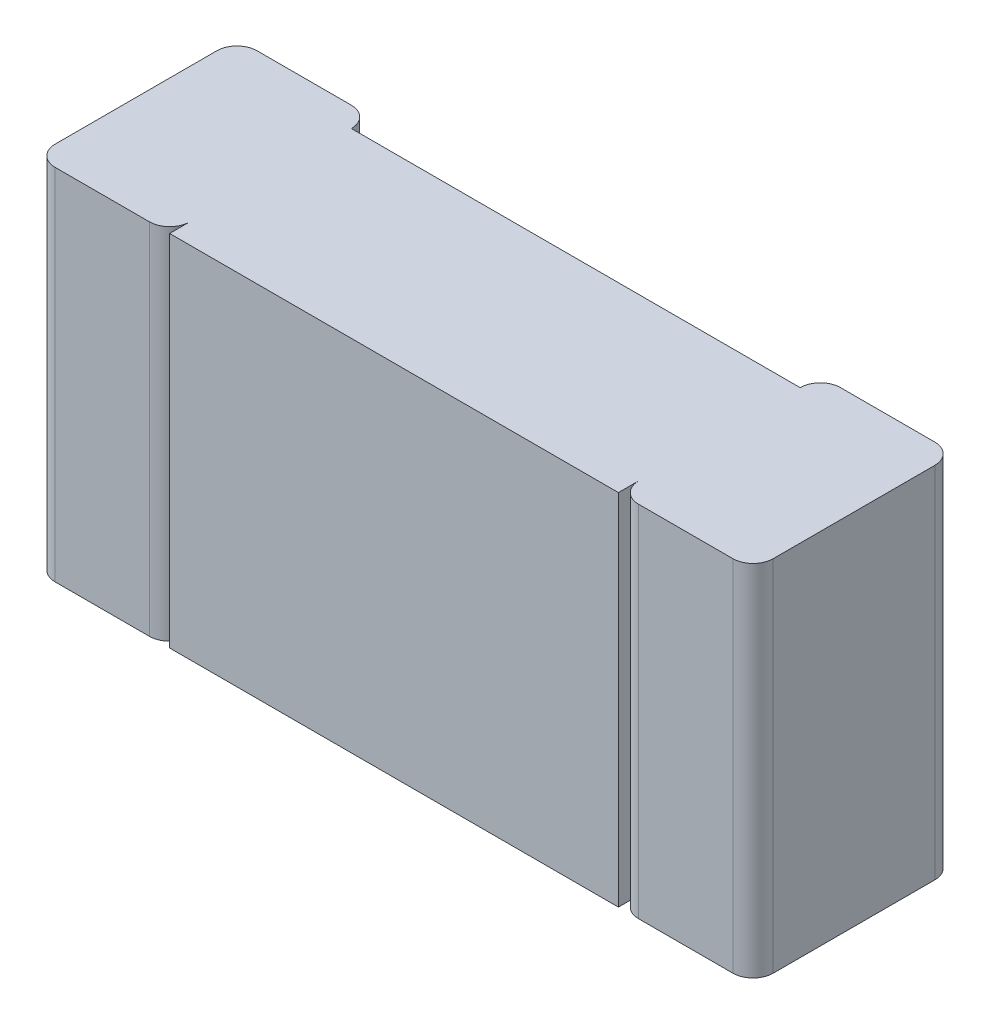
ISO-10303-21;
HEADER;
FILE_DESCRIPTION(('STEP AP214'),'2;1');
FILE_NAME('part.step','',(''),(''),'','','');
FILE_SCHEMA(('AUTOMOTIVE_DESIGN { 1 0 10303 214 1 1 1 1 }'));
ENDSEC;
DATA;
#1=APPLICATION_CONTEXT('core data for automotive mechanical design processes');
#2=APPLICATION_PROTOCOL_DEFINITION('international standard','automotive_design',2000,#1);
#3=PRODUCT_CONTEXT('',#1,'mechanical');
#4=PRODUCT('Part','Part','',(#3));
#5=PRODUCT_RELATED_PRODUCT_CATEGORY('part','',(#4));
#6=PRODUCT_DEFINITION_FORMATION('','',#4);
#7=PRODUCT_DEFINITION_CONTEXT('part definition',#1,'design');
#8=PRODUCT_DEFINITION('design','',#6,#7);
#9=PRODUCT_DEFINITION_SHAPE('','',#8);
#10=(LENGTH_UNIT() NAMED_UNIT(*) SI_UNIT(.MILLI.,.METRE.));
#11=(NAMED_UNIT(*) PLANE_ANGLE_UNIT() SI_UNIT($,.RADIAN.));
#12=(NAMED_UNIT(*) SI_UNIT($,.STERADIAN.) SOLID_ANGLE_UNIT());
#13=UNCERTAINTY_MEASURE_WITH_UNIT(LENGTH_MEASURE(1.E-05),#10,'distance_accuracy_value','');
#14=(GEOMETRIC_REPRESENTATION_CONTEXT(3) GLOBAL_UNCERTAINTY_ASSIGNED_CONTEXT((#13)) GLOBAL_UNIT_ASSIGNED_CONTEXT((#10,
#11,#12)) REPRESENTATION_CONTEXT('',''));
#15=CARTESIAN_POINT('',(0.,0.,0.));
#16=DIRECTION('',(0.,0.,1.));
#17=DIRECTION('',(1.,0.,0.));
#18=AXIS2_PLACEMENT_3D('',#15,#16,#17);
#19=CARTESIAN_POINT('',(-0.5,-0.4,0.405));
#20=DIRECTION('',(1.,0.,0.));
#21=DIRECTION('',(0.,0.,-1.));
#22=AXIS2_PLACEMENT_3D('',#19,#20,#21);
#23=PLANE('',#22);
#24=DIRECTION('',(0.,1.,0.));
#25=VECTOR('',#24,1.);
#26=CARTESIAN_POINT('',(-0.5,-0.4,0.45));
#27=LINE('',#26,#25);
#28=CARTESIAN_POINT('',(-0.5,0.4,0.45));
#29=VERTEX_POINT('',#28);
#30=CARTESIAN_POINT('',(-0.5,-0.4,0.45));
#31=VERTEX_POINT('',#30);
#32=EDGE_CURVE('E196',#29,#31,#27,.F.);
#33=ORIENTED_EDGE('',*,*,#32,.F.);
#34=DIRECTION('',(0.,0.,1.));
#35=VECTOR('',#34,1.);
#36=CARTESIAN_POINT('',(-0.5,0.4,0.405));
#37=LINE('',#36,#35);
#38=CARTESIAN_POINT('',(-0.5,0.4,0.405));
#39=VERTEX_POINT('',#38);
#40=EDGE_CURVE('E203',#39,#29,#37,.T.);
#41=ORIENTED_EDGE('',*,*,#40,.F.);
#42=DIRECTION('',(0.,1.,0.));
#43=VECTOR('',#42,1.);
#44=CARTESIAN_POINT('',(-0.5,-0.4,0.405));
#45=LINE('',#44,#43);
#46=CARTESIAN_POINT('',(-0.5,-0.4,0.405));
#47=VERTEX_POINT('',#46);
#48=EDGE_CURVE('E172',#47,#39,#45,.T.);
#49=ORIENTED_EDGE('',*,*,#48,.F.);
#50=DIRECTION('',(0.,0.,1.));
#51=VECTOR('',#50,1.);
#52=CARTESIAN_POINT('',(-0.5,-0.4,0.405));
#53=LINE('',#52,#51);
#54=EDGE_CURVE('E159',#47,#31,#53,.T.);
#55=ORIENTED_EDGE('',*,*,#54,.T.);
#56=EDGE_LOOP('',(#33,#41,#49,#55));
#57=FACE_BOUND('',#56,.T.);
#58=ADVANCED_FACE('F17',(#57),#23,.F.);
#59=CARTESIAN_POINT('',(-0.5,-0.4,0.45));
#60=DIRECTION('',(0.,0.,1.));
#61=DIRECTION('',(1.,0.,0.));
#62=AXIS2_PLACEMENT_3D('',#59,#60,#61);
#63=PLANE('',#62);
#64=DIRECTION('',(0.,1.,0.));
#65=VECTOR('',#64,1.);
#66=CARTESIAN_POINT('',(0.5,-0.4,0.45));
#67=LINE('',#66,#65);
#68=CARTESIAN_POINT('',(0.5,0.4,0.45));
#69=VERTEX_POINT('',#68);
#70=CARTESIAN_POINT('',(0.5,-0.4,0.45));
#71=VERTEX_POINT('',#70);
#72=EDGE_CURVE('E139',#69,#71,#67,.F.);
#73=ORIENTED_EDGE('',*,*,#72,.F.);
#74=DIRECTION('',(1.,0.,0.));
#75=VECTOR('',#74,1.);
#76=CARTESIAN_POINT('',(-0.5,0.4,0.45));
#77=LINE('',#76,#75);
#78=EDGE_CURVE('E199',#29,#69,#77,.T.);
#79=ORIENTED_EDGE('',*,*,#78,.F.);
#80=ORIENTED_EDGE('',*,*,#32,.T.);
#81=DIRECTION('',(1.,0.,0.));
#82=VECTOR('',#81,1.);
#83=CARTESIAN_POINT('',(-0.5,-0.4,0.45));
#84=LINE('',#83,#82);
#85=EDGE_CURVE('E156',#31,#71,#84,.T.);
#86=ORIENTED_EDGE('',*,*,#85,.T.);
#87=EDGE_LOOP('',(#73,#79,#80,#86));
#88=FACE_BOUND('',#87,.T.);
#89=ADVANCED_FACE('F359',(#88),#63,.T.);
#90=CARTESIAN_POINT('',(0.5,-0.4,0.405));
#91=DIRECTION('',(1.,0.,0.));
#92=DIRECTION('',(0.,0.,-1.));
#93=AXIS2_PLACEMENT_3D('',#90,#91,#92);
#94=PLANE('',#93);
#95=DIRECTION('',(0.,0.,1.));
#96=VECTOR('',#95,1.);
#97=CARTESIAN_POINT('',(0.5,0.4,0.405));
#98=LINE('',#97,#96);
#99=CARTESIAN_POINT('',(0.5,0.4,0.405));
#100=VERTEX_POINT('',#99);
#101=EDGE_CURVE('E202',#69,#100,#98,.F.);
#102=ORIENTED_EDGE('',*,*,#101,.F.);
#103=ORIENTED_EDGE('',*,*,#72,.T.);
#104=DIRECTION('',(0.,0.,1.));
#105=VECTOR('',#104,1.);
#106=CARTESIAN_POINT('',(0.5,-0.4,0.405));
#107=LINE('',#106,#105);
#108=CARTESIAN_POINT('',(0.5,-0.4,0.405));
#109=VERTEX_POINT('',#108);
#110=EDGE_CURVE('E147',#71,#109,#107,.F.);
#111=ORIENTED_EDGE('',*,*,#110,.T.);
#112=DIRECTION('',(0.,1.,0.));
#113=VECTOR('',#112,1.);
#114=CARTESIAN_POINT('',(0.5,-0.4,0.405));
#115=LINE('',#114,#113);
#116=EDGE_CURVE('E130',#100,#109,#115,.F.);
#117=ORIENTED_EDGE('',*,*,#116,.F.);
#118=EDGE_LOOP('',(#102,#103,#111,#117));
#119=FACE_BOUND('',#118,.T.);
#120=ADVANCED_FACE('F154',(#119),#94,.T.);
#121=CARTESIAN_POINT('',(0.545,-0.4,0.405));
#122=DIRECTION('',(0.,1.,0.));
#123=DIRECTION('',(0.,0.,1.));
#124=AXIS2_PLACEMENT_3D('',#121,#122,#123);
#125=CYLINDRICAL_SURFACE('',#124,0.045);
#126=CARTESIAN_POINT('',(0.545,0.4,0.405));
#127=DIRECTION('',(0.,1.,0.));
#128=DIRECTION('',(0.,0.,1.));
#129=AXIS2_PLACEMENT_3D('',#126,#127,#128);
#130=CIRCLE('',#129,0.045);
#131=CARTESIAN_POINT('',(0.545,0.4,0.45));
#132=VERTEX_POINT('',#131);
#133=EDGE_CURVE('E134',#100,#132,#130,.T.);
#134=ORIENTED_EDGE('',*,*,#133,.F.);
#135=ORIENTED_EDGE('',*,*,#116,.T.);
#136=CARTESIAN_POINT('',(0.545,-0.4,0.405));
#137=DIRECTION('',(0.,1.,0.));
#138=DIRECTION('',(0.,0.,1.));
#139=AXIS2_PLACEMENT_3D('',#136,#137,#138);
#140=CIRCLE('',#139,0.045);
#141=CARTESIAN_POINT('',(0.545,-0.4,0.45));
#142=VERTEX_POINT('',#141);
#143=EDGE_CURVE('E20',#109,#142,#140,.T.);
#144=ORIENTED_EDGE('',*,*,#143,.T.);
#145=DIRECTION('',(0.,1.,0.));
#146=VECTOR('',#145,1.);
#147=CARTESIAN_POINT('',(0.545,-0.4,0.45));
#148=LINE('',#147,#146);
#149=EDGE_CURVE('E138',#132,#142,#148,.F.);
#150=ORIENTED_EDGE('',*,*,#149,.F.);
#151=EDGE_LOOP('',(#134,#135,#144,#150));
#152=FACE_BOUND('',#151,.T.);
#153=ADVANCED_FACE('F132',(#152),#125,.T.);
#154=CARTESIAN_POINT('',(0.5,-0.4,0.45));
#155=DIRECTION('',(0.,0.,1.));
#156=DIRECTION('',(1.,0.,0.));
#157=AXIS2_PLACEMENT_3D('',#154,#155,#156);
#158=PLANE('',#157);
#159=DIRECTION('',(1.,0.,0.));
#160=VECTOR('',#159,1.);
#161=CARTESIAN_POINT('',(0.5,-0.4,0.45));
#162=LINE('',#161,#160);
#163=CARTESIAN_POINT('',(0.755,-0.4,0.45));
#164=VERTEX_POINT('',#163);
#165=EDGE_CURVE('E151',#142,#164,#162,.T.);
#166=ORIENTED_EDGE('',*,*,#165,.T.);
#167=DIRECTION('',(0.,1.,0.));
#168=VECTOR('',#167,1.);
#169=CARTESIAN_POINT('',(0.755,-0.4,0.45));
#170=LINE('',#169,#168);
#171=CARTESIAN_POINT('',(0.755,0.4,0.45));
#172=VERTEX_POINT('',#171);
#173=EDGE_CURVE('E191',#172,#164,#170,.F.);
#174=ORIENTED_EDGE('',*,*,#173,.F.);
#175=DIRECTION('',(1.,0.,0.));
#176=VECTOR('',#175,1.);
#177=CARTESIAN_POINT('',(0.5,0.4,0.45));
#178=LINE('',#177,#176);
#179=EDGE_CURVE('E248',#132,#172,#178,.T.);
#180=ORIENTED_EDGE('',*,*,#179,.F.);
#181=ORIENTED_EDGE('',*,*,#149,.T.);
#182=EDGE_LOOP('',(#166,#174,#180,#181));
#183=FACE_BOUND('',#182,.T.);
#184=ADVANCED_FACE('F316',(#183),#158,.T.);
#185=CARTESIAN_POINT('',(0.755,-0.4,0.405));
#186=DIRECTION('',(0.,1.,0.));
#187=DIRECTION('',(0.,0.,1.));
#188=AXIS2_PLACEMENT_3D('',#185,#186,#187);
#189=CYLINDRICAL_SURFACE('',#188,0.045);
#190=ORIENTED_EDGE('',*,*,#173,.T.);
#191=CARTESIAN_POINT('',(0.755,-0.4,0.405));
#192=DIRECTION('',(0.,1.,0.));
#193=DIRECTION('',(0.,0.,1.));
#194=AXIS2_PLACEMENT_3D('',#191,#192,#193);
#195=CIRCLE('',#194,0.045);
#196=CARTESIAN_POINT('',(0.8,-0.4,0.405));
#197=VERTEX_POINT('',#196);
#198=EDGE_CURVE('E255',#164,#197,#195,.T.);
#199=ORIENTED_EDGE('',*,*,#198,.T.);
#200=DIRECTION('',(0.,1.,0.));
#201=VECTOR('',#200,1.);
#202=CARTESIAN_POINT('',(0.8,-0.4,0.405));
#203=LINE('',#202,#201);
#204=CARTESIAN_POINT('',(0.8,0.4,0.405));
#205=VERTEX_POINT('',#204);
#206=EDGE_CURVE('E189',#205,#197,#203,.F.);
#207=ORIENTED_EDGE('',*,*,#206,.F.);
#208=CARTESIAN_POINT('',(0.755,0.4,0.405));
#209=DIRECTION('',(0.,1.,0.));
#210=DIRECTION('',(0.,0.,1.));
#211=AXIS2_PLACEMENT_3D('',#208,#209,#210);
#212=CIRCLE('',#211,0.045);
#213=EDGE_CURVE('E246',#172,#205,#212,.T.);
#214=ORIENTED_EDGE('',*,*,#213,.F.);
#215=EDGE_LOOP('',(#190,#199,#207,#214));
#216=FACE_BOUND('',#215,.T.);
#217=ADVANCED_FACE('F320',(#216),#189,.T.);
#218=CARTESIAN_POINT('',(0.8,-0.4,0.));
#219=DIRECTION('',(1.,0.,0.));
#220=DIRECTION('',(0.,0.,-1.));
#221=AXIS2_PLACEMENT_3D('',#218,#219,#220);
#222=PLANE('',#221);
#223=DIRECTION('',(0.,0.,1.));
#224=VECTOR('',#223,1.);
#225=CARTESIAN_POINT('',(0.8,0.4,0.));
#226=LINE('',#225,#224);
#227=CARTESIAN_POINT('',(0.8,0.4,0.045));
#228=VERTEX_POINT('',#227);
#229=EDGE_CURVE('E245',#205,#228,#226,.F.);
#230=ORIENTED_EDGE('',*,*,#229,.F.);
#231=ORIENTED_EDGE('',*,*,#206,.T.);
#232=DIRECTION('',(0.,0.,1.));
#233=VECTOR('',#232,1.);
#234=CARTESIAN_POINT('',(0.8,-0.4,0.));
#235=LINE('',#234,#233);
#236=CARTESIAN_POINT('',(0.8,-0.4,0.045));
#237=VERTEX_POINT('',#236);
#238=EDGE_CURVE('E254',#197,#237,#235,.F.);
#239=ORIENTED_EDGE('',*,*,#238,.T.);
#240=DIRECTION('',(0.,1.,0.));
#241=VECTOR('',#240,1.);
#242=CARTESIAN_POINT('',(0.8,-0.4,0.045));
#243=LINE('',#242,#241);
#244=EDGE_CURVE('E182',#228,#237,#243,.F.);
#245=ORIENTED_EDGE('',*,*,#244,.F.);
#246=EDGE_LOOP('',(#230,#231,#239,#245));
#247=FACE_BOUND('',#246,.T.);
#248=ADVANCED_FACE('F323',(#247),#222,.T.);
#249=CARTESIAN_POINT('',(0.755,-0.4,0.045));
#250=DIRECTION('',(0.,1.,0.));
#251=DIRECTION('',(0.,0.,1.));
#252=AXIS2_PLACEMENT_3D('',#249,#250,#251);
#253=CYLINDRICAL_SURFACE('',#252,0.045);
#254=CARTESIAN_POINT('',(0.755,0.4,0.045));
#255=DIRECTION('',(0.,1.,0.));
#256=DIRECTION('',(0.,0.,1.));
#257=AXIS2_PLACEMENT_3D('',#254,#255,#256);
#258=CIRCLE('',#257,0.045);
#259=CARTESIAN_POINT('',(0.755,0.4,0.));
#260=VERTEX_POINT('',#259);
#261=EDGE_CURVE('E242',#228,#260,#258,.T.);
#262=ORIENTED_EDGE('',*,*,#261,.F.);
#263=ORIENTED_EDGE('',*,*,#244,.T.);
#264=CARTESIAN_POINT('',(0.755,-0.4,0.045));
#265=DIRECTION('',(0.,1.,0.));
#266=DIRECTION('',(0.,0.,1.));
#267=AXIS2_PLACEMENT_3D('',#264,#265,#266);
#268=CIRCLE('',#267,0.045);
#269=CARTESIAN_POINT('',(0.755,-0.4,0.));
#270=VERTEX_POINT('',#269);
#271=EDGE_CURVE('E251',#237,#270,#268,.T.);
#272=ORIENTED_EDGE('',*,*,#271,.T.);
#273=DIRECTION('',(0.,1.,0.));
#274=VECTOR('',#273,1.);
#275=CARTESIAN_POINT('',(0.755,-0.4,0.));
#276=LINE('',#275,#274);
#277=EDGE_CURVE('E152',#270,#260,#276,.T.);
#278=ORIENTED_EDGE('',*,*,#277,.T.);
#279=EDGE_LOOP('',(#262,#263,#272,#278));
#280=FACE_BOUND('',#279,.T.);
#281=ADVANCED_FACE('F327',(#280),#253,.T.);
#282=CARTESIAN_POINT('',(-0.755,-0.4,0.045));
#283=DIRECTION('',(0.,1.,0.));
#284=DIRECTION('',(0.,0.,1.));
#285=AXIS2_PLACEMENT_3D('',#282,#283,#284);
#286=CYLINDRICAL_SURFACE('',#285,0.045);
#287=DIRECTION('',(0.,1.,0.));
#288=VECTOR('',#287,1.);
#289=CARTESIAN_POINT('',(-0.755,-0.4,0.));
#290=LINE('',#289,#288);
#291=CARTESIAN_POINT('',(-0.755,0.4,0.));
#292=VERTEX_POINT('',#291);
#293=CARTESIAN_POINT('',(-0.755,-0.4,0.));
#294=VERTEX_POINT('',#293);
#295=EDGE_CURVE('E183',#292,#294,#290,.F.);
#296=ORIENTED_EDGE('',*,*,#295,.T.);
#297=CARTESIAN_POINT('',(-0.755,-0.4,0.045));
#298=DIRECTION('',(0.,1.,0.));
#299=DIRECTION('',(0.,0.,1.));
#300=AXIS2_PLACEMENT_3D('',#297,#298,#299);
#301=CIRCLE('',#300,0.045);
#302=CARTESIAN_POINT('',(-0.8,-0.4,0.045));
#303=VERTEX_POINT('',#302);
#304=EDGE_CURVE('E239',#294,#303,#301,.T.);
#305=ORIENTED_EDGE('',*,*,#304,.T.);
#306=DIRECTION('',(0.,1.,0.));
#307=VECTOR('',#306,1.);
#308=CARTESIAN_POINT('',(-0.8,-0.4,0.045));
#309=LINE('',#308,#307);
#310=CARTESIAN_POINT('',(-0.8,0.4,0.045));
#311=VERTEX_POINT('',#310);
#312=EDGE_CURVE('E179',#303,#311,#309,.T.);
#313=ORIENTED_EDGE('',*,*,#312,.T.);
#314=CARTESIAN_POINT('',(-0.755,0.4,0.045));
#315=DIRECTION('',(0.,1.,0.));
#316=DIRECTION('',(0.,0.,1.));
#317=AXIS2_PLACEMENT_3D('',#314,#315,#316);
#318=CIRCLE('',#317,0.045);
#319=EDGE_CURVE('E229',#292,#311,#318,.T.);
#320=ORIENTED_EDGE('',*,*,#319,.F.);
#321=EDGE_LOOP('',(#296,#305,#313,#320));
#322=FACE_BOUND('',#321,.T.);
#323=ADVANCED_FACE('F350',(#322),#286,.T.);
#324=CARTESIAN_POINT('',(-0.8,-0.4,0.));
#325=DIRECTION('',(1.,0.,0.));
#326=DIRECTION('',(0.,0.,-1.));
#327=AXIS2_PLACEMENT_3D('',#324,#325,#326);
#328=PLANE('',#327);
#329=DIRECTION('',(0.,1.,0.));
#330=VECTOR('',#329,1.);
#331=CARTESIAN_POINT('',(-0.8,-0.4,0.405));
#332=LINE('',#331,#330);
#333=CARTESIAN_POINT('',(-0.8,0.4,0.405));
#334=VERTEX_POINT('',#333);
#335=CARTESIAN_POINT('',(-0.8,-0.4,0.405));
#336=VERTEX_POINT('',#335);
#337=EDGE_CURVE('E177',#334,#336,#332,.F.);
#338=ORIENTED_EDGE('',*,*,#337,.F.);
#339=DIRECTION('',(0.,0.,1.));
#340=VECTOR('',#339,1.);
#341=CARTESIAN_POINT('',(-0.8,0.4,0.));
#342=LINE('',#341,#340);
#343=EDGE_CURVE('E228',#311,#334,#342,.T.);
#344=ORIENTED_EDGE('',*,*,#343,.F.);
#345=ORIENTED_EDGE('',*,*,#312,.F.);
#346=DIRECTION('',(0.,0.,1.));
#347=VECTOR('',#346,1.);
#348=CARTESIAN_POINT('',(-0.8,-0.4,0.));
#349=LINE('',#348,#347);
#350=EDGE_CURVE('E238',#303,#336,#349,.T.);
#351=ORIENTED_EDGE('',*,*,#350,.T.);
#352=EDGE_LOOP('',(#338,#344,#345,#351));
#353=FACE_BOUND('',#352,.T.);
#354=ADVANCED_FACE('F354',(#353),#328,.F.);
#355=CARTESIAN_POINT('',(-0.755,-0.4,0.405));
#356=DIRECTION('',(0.,1.,0.));
#357=DIRECTION('',(0.,0.,1.));
#358=AXIS2_PLACEMENT_3D('',#355,#356,#357);
#359=CYLINDRICAL_SURFACE('',#358,0.045);
#360=CARTESIAN_POINT('',(-0.755,0.4,0.405));
#361=DIRECTION('',(0.,1.,0.));
#362=DIRECTION('',(0.,0.,1.));
#363=AXIS2_PLACEMENT_3D('',#360,#361,#362);
#364=CIRCLE('',#363,0.045);
#365=CARTESIAN_POINT('',(-0.755,0.4,0.45));
#366=VERTEX_POINT('',#365);
#367=EDGE_CURVE('E226',#334,#366,#364,.T.);
#368=ORIENTED_EDGE('',*,*,#367,.F.);
#369=ORIENTED_EDGE('',*,*,#337,.T.);
#370=CARTESIAN_POINT('',(-0.755,-0.4,0.405));
#371=DIRECTION('',(0.,1.,0.));
#372=DIRECTION('',(0.,0.,1.));
#373=AXIS2_PLACEMENT_3D('',#370,#371,#372);
#374=CIRCLE('',#373,0.045);
#375=CARTESIAN_POINT('',(-0.755,-0.4,0.45));
#376=VERTEX_POINT('',#375);
#377=EDGE_CURVE('E235',#336,#376,#374,.T.);
#378=ORIENTED_EDGE('',*,*,#377,.T.);
#379=DIRECTION('',(0.,1.,0.));
#380=VECTOR('',#379,1.);
#381=CARTESIAN_POINT('',(-0.755,-0.4,0.45));
#382=LINE('',#381,#380);
#383=EDGE_CURVE('E174',#366,#376,#382,.F.);
#384=ORIENTED_EDGE('',*,*,#383,.F.);
#385=EDGE_LOOP('',(#368,#369,#378,#384));
#386=FACE_BOUND('',#385,.T.);
#387=ADVANCED_FACE('F357',(#386),#359,.T.);
#388=CARTESIAN_POINT('',(-0.8,-0.4,0.45));
#389=DIRECTION('',(0.,0.,1.));
#390=DIRECTION('',(1.,0.,0.));
#391=AXIS2_PLACEMENT_3D('',#388,#389,#390);
#392=PLANE('',#391);
#393=DIRECTION('',(1.,0.,0.));
#394=VECTOR('',#393,1.);
#395=CARTESIAN_POINT('',(-0.8,-0.4,0.45));
#396=LINE('',#395,#394);
#397=CARTESIAN_POINT('',(-0.545,-0.4,0.45));
#398=VERTEX_POINT('',#397);
#399=EDGE_CURVE('E234',#376,#398,#396,.T.);
#400=ORIENTED_EDGE('',*,*,#399,.T.);
#401=DIRECTION('',(0.,1.,0.));
#402=VECTOR('',#401,1.);
#403=CARTESIAN_POINT('',(-0.545,-0.4,0.45));
#404=LINE('',#403,#402);
#405=CARTESIAN_POINT('',(-0.545,0.4,0.45));
#406=VERTEX_POINT('',#405);
#407=EDGE_CURVE('E169',#406,#398,#404,.F.);
#408=ORIENTED_EDGE('',*,*,#407,.F.);
#409=DIRECTION('',(1.,0.,0.));
#410=VECTOR('',#409,1.);
#411=CARTESIAN_POINT('',(-0.8,0.4,0.45));
#412=LINE('',#411,#410);
#413=EDGE_CURVE('E225',#366,#406,#412,.T.);
#414=ORIENTED_EDGE('',*,*,#413,.F.);
#415=ORIENTED_EDGE('',*,*,#383,.T.);
#416=EDGE_LOOP('',(#400,#408,#414,#415));
#417=FACE_BOUND('',#416,.T.);
#418=ADVANCED_FACE('F302',(#417),#392,.T.);
#419=CARTESIAN_POINT('',(-0.545,-0.4,0.405));
#420=DIRECTION('',(0.,1.,0.));
#421=DIRECTION('',(0.,0.,1.));
#422=AXIS2_PLACEMENT_3D('',#419,#420,#421);
#423=CYLINDRICAL_SURFACE('',#422,0.045);
#424=ORIENTED_EDGE('',*,*,#407,.T.);
#425=CARTESIAN_POINT('',(-0.545,-0.4,0.405));
#426=DIRECTION('',(0.,1.,0.));
#427=DIRECTION('',(0.,0.,1.));
#428=AXIS2_PLACEMENT_3D('',#425,#426,#427);
#429=CIRCLE('',#428,0.045);
#430=EDGE_CURVE('E187',#398,#47,#429,.T.);
#431=ORIENTED_EDGE('',*,*,#430,.T.);
#432=ORIENTED_EDGE('',*,*,#48,.T.);
#433=CARTESIAN_POINT('',(-0.545,0.4,0.405));
#434=DIRECTION('',(0.,1.,0.));
#435=DIRECTION('',(0.,0.,1.));
#436=AXIS2_PLACEMENT_3D('',#433,#434,#435);
#437=CIRCLE('',#436,0.045);
#438=EDGE_CURVE('E222',#406,#39,#437,.T.);
#439=ORIENTED_EDGE('',*,*,#438,.F.);
#440=EDGE_LOOP('',(#424,#431,#432,#439));
#441=FACE_BOUND('',#440,.T.);
#442=ADVANCED_FACE('F306',(#441),#423,.T.);
#443=CARTESIAN_POINT('',(0.5,-0.4,0.));
#444=DIRECTION('',(0.,0.,1.));
#445=DIRECTION('',(1.,0.,0.));
#446=AXIS2_PLACEMENT_3D('',#443,#444,#445);
#447=PLANE('',#446);
#448=ORIENTED_EDGE('',*,*,#277,.F.);
#449=DIRECTION('',(1.,0.,0.));
#450=VECTOR('',#449,1.);
#451=CARTESIAN_POINT('',(0.5,-0.4,0.));
#452=LINE('',#451,#450);
#453=CARTESIAN_POINT('',(0.545,-0.4,0.));
#454=VERTEX_POINT('',#453);
#455=EDGE_CURVE('E253',#270,#454,#452,.F.);
#456=ORIENTED_EDGE('',*,*,#455,.T.);
#457=DIRECTION('',(0.,1.,0.));
#458=VECTOR('',#457,1.);
#459=CARTESIAN_POINT('',(0.545,-0.4,0.));
#460=LINE('',#459,#458);
#461=CARTESIAN_POINT('',(0.545,0.4,0.));
#462=VERTEX_POINT('',#461);
#463=EDGE_CURVE('E163',#462,#454,#460,.F.);
#464=ORIENTED_EDGE('',*,*,#463,.F.);
#465=DIRECTION('',(1.,0.,0.));
#466=VECTOR('',#465,1.);
#467=CARTESIAN_POINT('',(0.5,0.4,0.));
#468=LINE('',#467,#466);
#469=EDGE_CURVE('E250',#260,#462,#468,.F.);
#470=ORIENTED_EDGE('',*,*,#469,.F.);
#471=EDGE_LOOP('',(#448,#456,#464,#470));
#472=FACE_BOUND('',#471,.T.);
#473=ADVANCED_FACE('F331',(#472),#447,.F.);
#474=CARTESIAN_POINT('',(-0.8,-0.4,0.));
#475=DIRECTION('',(0.,0.,1.));
#476=DIRECTION('',(1.,0.,0.));
#477=AXIS2_PLACEMENT_3D('',#474,#475,#476);
#478=PLANE('',#477);
#479=DIRECTION('',(0.,1.,0.));
#480=VECTOR('',#479,1.);
#481=CARTESIAN_POINT('',(-0.545,-0.4,0.));
#482=LINE('',#481,#480);
#483=CARTESIAN_POINT('',(-0.545,-0.4,0.));
#484=VERTEX_POINT('',#483);
#485=CARTESIAN_POINT('',(-0.545,0.4,0.));
#486=VERTEX_POINT('',#485);
#487=EDGE_CURVE('E214',#484,#486,#482,.T.);
#488=ORIENTED_EDGE('',*,*,#487,.F.);
#489=DIRECTION('',(1.,0.,0.));
#490=VECTOR('',#489,1.);
#491=CARTESIAN_POINT('',(-0.8,-0.4,0.));
#492=LINE('',#491,#490);
#493=EDGE_CURVE('E186',#294,#484,#492,.T.);
#494=ORIENTED_EDGE('',*,*,#493,.F.);
#495=ORIENTED_EDGE('',*,*,#295,.F.);
#496=DIRECTION('',(1.,0.,0.));
#497=VECTOR('',#496,1.);
#498=CARTESIAN_POINT('',(-0.8,0.4,0.));
#499=LINE('',#498,#497);
#500=EDGE_CURVE('E231',#486,#292,#499,.F.);
#501=ORIENTED_EDGE('',*,*,#500,.F.);
#502=EDGE_LOOP('',(#488,#494,#495,#501));
#503=FACE_BOUND('',#502,.T.);
#504=ADVANCED_FACE('F347',(#503),#478,.F.);
#505=CARTESIAN_POINT('',(-0.755,-0.4,0.045));
#506=DIRECTION('',(0.,1.,0.));
#507=DIRECTION('',(0.,0.,1.));
#508=AXIS2_PLACEMENT_3D('',#505,#506,#507);
#509=PLANE('',#508);
#510=ORIENTED_EDGE('',*,*,#54,.F.);
#511=ORIENTED_EDGE('',*,*,#430,.F.);
#512=ORIENTED_EDGE('',*,*,#399,.F.);
#513=ORIENTED_EDGE('',*,*,#377,.F.);
#514=ORIENTED_EDGE('',*,*,#350,.F.);
#515=ORIENTED_EDGE('',*,*,#304,.F.);
#516=ORIENTED_EDGE('',*,*,#493,.T.);
#517=CARTESIAN_POINT('',(-0.545,-0.4,0.045));
#518=DIRECTION('',(0.,1.,0.));
#519=DIRECTION('',(0.,0.,1.));
#520=AXIS2_PLACEMENT_3D('',#517,#518,#519);
#521=CIRCLE('',#520,0.045);
#522=CARTESIAN_POINT('',(-0.5,-0.4,0.045));
#523=VERTEX_POINT('',#522);
#524=EDGE_CURVE('E215',#523,#484,#521,.T.);
#525=ORIENTED_EDGE('',*,*,#524,.F.);
#526=DIRECTION('',(1.,0.,0.));
#527=VECTOR('',#526,1.);
#528=CARTESIAN_POINT('',(-0.755,-0.4,0.045));
#529=LINE('',#528,#527);
#530=CARTESIAN_POINT('',(0.5,-0.4,0.045));
#531=VERTEX_POINT('',#530);
#532=EDGE_CURVE('E213',#523,#531,#529,.T.);
#533=ORIENTED_EDGE('',*,*,#532,.T.);
#534=CARTESIAN_POINT('',(0.545,-0.4,0.045));
#535=DIRECTION('',(0.,1.,0.));
#536=DIRECTION('',(0.,0.,1.));
#537=AXIS2_PLACEMENT_3D('',#534,#535,#536);
#538=CIRCLE('',#537,0.045);
#539=EDGE_CURVE('E217',#454,#531,#538,.T.);
#540=ORIENTED_EDGE('',*,*,#539,.F.);
#541=ORIENTED_EDGE('',*,*,#455,.F.);
#542=ORIENTED_EDGE('',*,*,#271,.F.);
#543=ORIENTED_EDGE('',*,*,#238,.F.);
#544=ORIENTED_EDGE('',*,*,#198,.F.);
#545=ORIENTED_EDGE('',*,*,#165,.F.);
#546=ORIENTED_EDGE('',*,*,#143,.F.);
#547=ORIENTED_EDGE('',*,*,#110,.F.);
#548=ORIENTED_EDGE('',*,*,#85,.F.);
#549=EDGE_LOOP('',(#510,#511,#512,#513,#514,#515,#516,#525,#533,#540,#541,#542,#543,#544,#545,
#546,#547,#548));
#550=FACE_BOUND('',#549,.T.);
#551=ADVANCED_FACE('F144',(#550),#509,.F.);
#552=CARTESIAN_POINT('',(0.545,-0.4,0.045));
#553=DIRECTION('',(0.,1.,0.));
#554=DIRECTION('',(0.,0.,1.));
#555=AXIS2_PLACEMENT_3D('',#552,#553,#554);
#556=CYLINDRICAL_SURFACE('',#555,0.045);
#557=ORIENTED_EDGE('',*,*,#463,.T.);
#558=ORIENTED_EDGE('',*,*,#539,.T.);
#559=DIRECTION('',(0.,1.,0.));
#560=VECTOR('',#559,1.);
#561=CARTESIAN_POINT('',(0.5,-0.4,0.045));
#562=LINE('',#561,#560);
#563=CARTESIAN_POINT('',(0.5,0.4,0.045));
#564=VERTEX_POINT('',#563);
#565=EDGE_CURVE('E273',#531,#564,#562,.T.);
#566=ORIENTED_EDGE('',*,*,#565,.T.);
#567=CARTESIAN_POINT('',(0.545,0.4,0.045));
#568=DIRECTION('',(0.,1.,0.));
#569=DIRECTION('',(0.,0.,1.));
#570=AXIS2_PLACEMENT_3D('',#567,#568,#569);
#571=CIRCLE('',#570,0.045);
#572=EDGE_CURVE('E219',#564,#462,#571,.F.);
#573=ORIENTED_EDGE('',*,*,#572,.T.);
#574=EDGE_LOOP('',(#557,#558,#566,#573));
#575=FACE_BOUND('',#574,.T.);
#576=ADVANCED_FACE('F335',(#575),#556,.T.);
#577=CARTESIAN_POINT('',(-0.755,0.4,0.045));
#578=DIRECTION('',(0.,1.,0.));
#579=DIRECTION('',(0.,0.,1.));
#580=AXIS2_PLACEMENT_3D('',#577,#578,#579);
#581=PLANE('',#580);
#582=DIRECTION('',(1.,0.,0.));
#583=VECTOR('',#582,1.);
#584=CARTESIAN_POINT('',(-0.755,0.4,0.045));
#585=LINE('',#584,#583);
#586=CARTESIAN_POINT('',(-0.5,0.4,0.045));
#587=VERTEX_POINT('',#586);
#588=EDGE_CURVE('E26',#564,#587,#585,.F.);
#589=ORIENTED_EDGE('',*,*,#588,.T.);
#590=CARTESIAN_POINT('',(-0.545,0.4,0.045));
#591=DIRECTION('',(0.,1.,0.));
#592=DIRECTION('',(0.,0.,1.));
#593=AXIS2_PLACEMENT_3D('',#590,#591,#592);
#594=CIRCLE('',#593,0.045);
#595=EDGE_CURVE('E34',#486,#587,#594,.F.);
#596=ORIENTED_EDGE('',*,*,#595,.F.);
#597=ORIENTED_EDGE('',*,*,#500,.T.);
#598=ORIENTED_EDGE('',*,*,#319,.T.);
#599=ORIENTED_EDGE('',*,*,#343,.T.);
#600=ORIENTED_EDGE('',*,*,#367,.T.);
#601=ORIENTED_EDGE('',*,*,#413,.T.);
#602=ORIENTED_EDGE('',*,*,#438,.T.);
#603=ORIENTED_EDGE('',*,*,#40,.T.);
#604=ORIENTED_EDGE('',*,*,#78,.T.);
#605=ORIENTED_EDGE('',*,*,#101,.T.);
#606=ORIENTED_EDGE('',*,*,#133,.T.);
#607=ORIENTED_EDGE('',*,*,#179,.T.);
#608=ORIENTED_EDGE('',*,*,#213,.T.);
#609=ORIENTED_EDGE('',*,*,#229,.T.);
#610=ORIENTED_EDGE('',*,*,#261,.T.);
#611=ORIENTED_EDGE('',*,*,#469,.T.);
#612=ORIENTED_EDGE('',*,*,#572,.F.);
#613=EDGE_LOOP('',(#589,#596,#597,#598,#599,#600,#601,#602,#603,#604,#605,#606,#607,#608,#609,
#610,#611,#612));
#614=FACE_BOUND('',#613,.T.);
#615=ADVANCED_FACE('F296',(#614),#581,.T.);
#616=CARTESIAN_POINT('',(-0.545,-0.4,0.045));
#617=DIRECTION('',(0.,1.,0.));
#618=DIRECTION('',(0.,0.,1.));
#619=AXIS2_PLACEMENT_3D('',#616,#617,#618);
#620=CYLINDRICAL_SURFACE('',#619,0.045);
#621=ORIENTED_EDGE('',*,*,#595,.T.);
#622=DIRECTION('',(0.,1.,0.));
#623=VECTOR('',#622,1.);
#624=CARTESIAN_POINT('',(-0.5,-0.4,0.045));
#625=LINE('',#624,#623);
#626=EDGE_CURVE('E11',#587,#523,#625,.F.);
#627=ORIENTED_EDGE('',*,*,#626,.T.);
#628=ORIENTED_EDGE('',*,*,#524,.T.);
#629=ORIENTED_EDGE('',*,*,#487,.T.);
#630=EDGE_LOOP('',(#621,#627,#628,#629));
#631=FACE_BOUND('',#630,.T.);
#632=ADVANCED_FACE('F341',(#631),#620,.T.);
#633=CARTESIAN_POINT('',(-0.755,-0.4,0.045));
#634=DIRECTION('',(0.,0.,1.));
#635=DIRECTION('',(1.,0.,0.));
#636=AXIS2_PLACEMENT_3D('',#633,#634,#635);
#637=PLANE('',#636);
#638=ORIENTED_EDGE('',*,*,#588,.F.);
#639=ORIENTED_EDGE('',*,*,#565,.F.);
#640=ORIENTED_EDGE('',*,*,#532,.F.);
#641=ORIENTED_EDGE('',*,*,#626,.F.);
#642=EDGE_LOOP('',(#638,#639,#640,#641));
#643=FACE_BOUND('',#642,.T.);
#644=ADVANCED_FACE('F339',(#643),#637,.F.);
#645=CLOSED_SHELL('',(#58,#89,#120,#153,#184,#217,#248,#281,#323,#354,#387,#418,#442,#473,#504,
#551,#576,#615,#632,#644));
#646=MANIFOLD_SOLID_BREP('B1',#645);
#647=ADVANCED_BREP_SHAPE_REPRESENTATION('',(#18,#646),#14);
#648=SHAPE_DEFINITION_REPRESENTATION(#9,#647);
ENDSEC;
END-ISO-10303-21;
